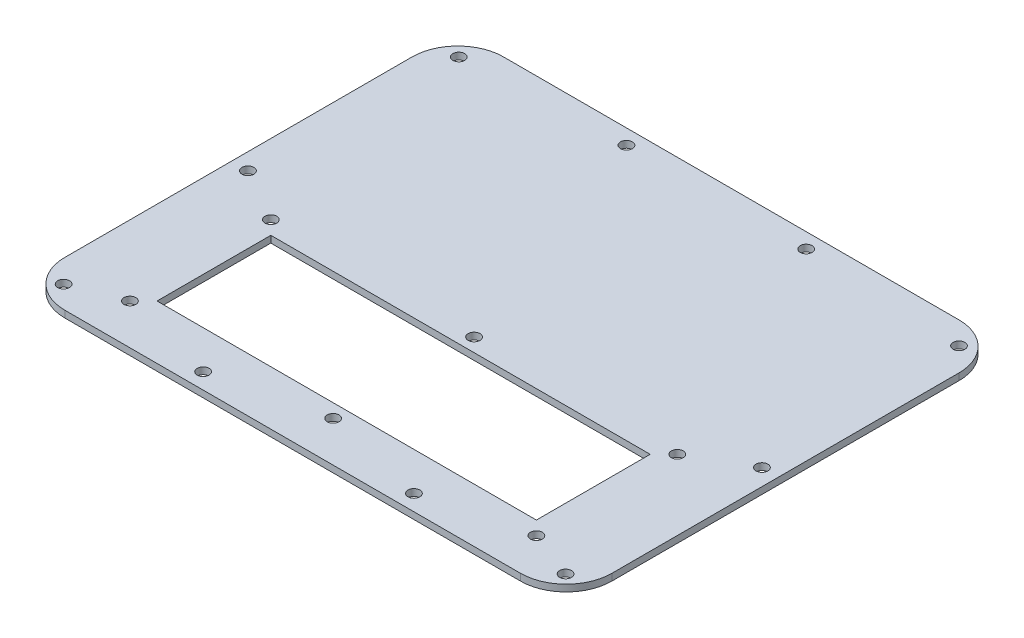
ISO-10303-21;
HEADER;
FILE_DESCRIPTION(('STEP AP214'),'2;1');
FILE_NAME('part.step','',(''),(''),'','','');
FILE_SCHEMA(('AUTOMOTIVE_DESIGN { 1 0 10303 214 1 1 1 1 }'));
ENDSEC;
DATA;
#1=APPLICATION_CONTEXT('core data for automotive mechanical design processes');
#2=APPLICATION_PROTOCOL_DEFINITION('international standard','automotive_design',2000,#1);
#3=PRODUCT_CONTEXT('',#1,'mechanical');
#4=PRODUCT('Part','Part','',(#3));
#5=PRODUCT_RELATED_PRODUCT_CATEGORY('part','',(#4));
#6=PRODUCT_DEFINITION_FORMATION('','',#4);
#7=PRODUCT_DEFINITION_CONTEXT('part definition',#1,'design');
#8=PRODUCT_DEFINITION('design','',#6,#7);
#9=PRODUCT_DEFINITION_SHAPE('','',#8);
#10=(LENGTH_UNIT() NAMED_UNIT(*) SI_UNIT(.MILLI.,.METRE.));
#11=(NAMED_UNIT(*) PLANE_ANGLE_UNIT() SI_UNIT($,.RADIAN.));
#12=(NAMED_UNIT(*) SI_UNIT($,.STERADIAN.) SOLID_ANGLE_UNIT());
#13=UNCERTAINTY_MEASURE_WITH_UNIT(LENGTH_MEASURE(1.E-05),#10,'distance_accuracy_value','');
#14=(GEOMETRIC_REPRESENTATION_CONTEXT(3) GLOBAL_UNCERTAINTY_ASSIGNED_CONTEXT((#13)) GLOBAL_UNIT_ASSIGNED_CONTEXT((#10,
#11,#12)) REPRESENTATION_CONTEXT('',''));
#15=CARTESIAN_POINT('',(0.,0.,0.));
#16=DIRECTION('',(0.,0.,1.));
#17=DIRECTION('',(1.,0.,0.));
#18=AXIS2_PLACEMENT_3D('',#15,#16,#17);
#19=CARTESIAN_POINT('',(-106.7689,3.175,81.3689000000001));
#20=DIRECTION('',(0.,-1.,0.));
#21=DIRECTION('',(0.,0.,-1.));
#22=AXIS2_PLACEMENT_3D('',#19,#20,#21);
#23=PLANE('',#22);
#24=CARTESIAN_POINT('',(-95.25,3.175,83.82));
#25=DIRECTION('',(0.,1.,0.));
#26=DIRECTION('',(0.,0.,-1.));
#27=AXIS2_PLACEMENT_3D('',#24,#25,#26);
#28=CIRCLE('',#27,2.7813);
#29=CARTESIAN_POINT('',(-95.25,3.175,81.0387));
#30=VERTEX_POINT('',#29);
#31=EDGE_CURVE('E532',#30,#30,#28,.T.);
#32=ORIENTED_EDGE('',*,*,#31,.F.);
#33=EDGE_LOOP('',(#32));
#34=FACE_BOUND('',#33,.T.);
#35=CARTESIAN_POINT('',(0.,3.175,83.82));
#36=DIRECTION('',(0.,1.,0.));
#37=DIRECTION('',(0.,0.,-1.));
#38=AXIS2_PLACEMENT_3D('',#35,#36,#37);
#39=CIRCLE('',#38,2.7813);
#40=CARTESIAN_POINT('',(0.,3.175,81.0387));
#41=VERTEX_POINT('',#40);
#42=EDGE_CURVE('E524',#41,#41,#39,.T.);
#43=ORIENTED_EDGE('',*,*,#42,.F.);
#44=EDGE_LOOP('',(#43));
#45=FACE_BOUND('',#44,.T.);
#46=CARTESIAN_POINT('',(95.25,3.175,83.82));
#47=DIRECTION('',(0.,1.,0.));
#48=DIRECTION('',(0.,0.,-1.));
#49=AXIS2_PLACEMENT_3D('',#46,#47,#48);
#50=CIRCLE('',#49,2.7813);
#51=CARTESIAN_POINT('',(95.25,3.175,81.0387));
#52=VERTEX_POINT('',#51);
#53=EDGE_CURVE('E516',#52,#52,#50,.T.);
#54=ORIENTED_EDGE('',*,*,#53,.F.);
#55=EDGE_LOOP('',(#54));
#56=FACE_BOUND('',#55,.T.);
#57=CARTESIAN_POINT('',(95.25,3.175,17.78));
#58=DIRECTION('',(0.,1.,0.));
#59=DIRECTION('',(0.,0.,1.));
#60=AXIS2_PLACEMENT_3D('',#57,#58,#59);
#61=CIRCLE('',#60,2.7813);
#62=CARTESIAN_POINT('',(95.25,3.175,20.5613));
#63=VERTEX_POINT('',#62);
#64=EDGE_CURVE('E508',#63,#63,#61,.T.);
#65=ORIENTED_EDGE('',*,*,#64,.F.);
#66=EDGE_LOOP('',(#65));
#67=FACE_BOUND('',#66,.T.);
#68=CARTESIAN_POINT('',(0.,3.175,17.78));
#69=DIRECTION('',(0.,1.,0.));
#70=DIRECTION('',(0.,0.,1.));
#71=AXIS2_PLACEMENT_3D('',#68,#69,#70);
#72=CIRCLE('',#71,2.7813);
#73=CARTESIAN_POINT('',(0.,3.175,20.5613));
#74=VERTEX_POINT('',#73);
#75=EDGE_CURVE('E491',#74,#74,#72,.T.);
#76=ORIENTED_EDGE('',*,*,#75,.F.);
#77=EDGE_LOOP('',(#76));
#78=FACE_BOUND('',#77,.T.);
#79=CARTESIAN_POINT('',(-95.25,3.175,17.78));
#80=DIRECTION('',(0.,1.,0.));
#81=DIRECTION('',(0.,0.,1.));
#82=AXIS2_PLACEMENT_3D('',#79,#80,#81);
#83=CIRCLE('',#82,2.7813);
#84=CARTESIAN_POINT('',(-95.25,3.175,20.5613));
#85=VERTEX_POINT('',#84);
#86=EDGE_CURVE('E168',#85,#85,#83,.T.);
#87=ORIENTED_EDGE('',*,*,#86,.F.);
#88=EDGE_LOOP('',(#87));
#89=FACE_BOUND('',#88,.T.);
#90=CARTESIAN_POINT('',(-42.1132000000002,3.175,-95.7452999999999));
#91=DIRECTION('',(0.,1.,0.));
#92=DIRECTION('',(0.,0.,-1.));
#93=AXIS2_PLACEMENT_3D('',#90,#91,#92);
#94=CIRCLE('',#93,2.7813);
#95=CARTESIAN_POINT('',(-42.1132000000002,3.175,-98.5265999999999));
#96=VERTEX_POINT('',#95);
#97=EDGE_CURVE('E184',#96,#96,#94,.T.);
#98=ORIENTED_EDGE('',*,*,#97,.F.);
#99=EDGE_LOOP('',(#98));
#100=FACE_BOUND('',#99,.T.);
#101=CARTESIAN_POINT('',(-117.221,3.175,-92.2908999999999));
#102=DIRECTION('',(0.,1.,0.));
#103=DIRECTION('',(0.,0.,-1.));
#104=AXIS2_PLACEMENT_3D('',#101,#102,#103);
#105=CIRCLE('',#104,2.7813);
#106=CARTESIAN_POINT('',(-117.221,3.175,-95.0721999999999));
#107=VERTEX_POINT('',#106);
#108=EDGE_CURVE('E192',#107,#107,#105,.T.);
#109=ORIENTED_EDGE('',*,*,#108,.F.);
#110=EDGE_LOOP('',(#109));
#111=FACE_BOUND('',#110,.T.);
#112=CARTESIAN_POINT('',(-120.4468,3.175,3.3147));
#113=DIRECTION('',(0.,1.,0.));
#114=DIRECTION('',(0.,0.,-1.));
#115=AXIS2_PLACEMENT_3D('',#112,#113,#114);
#116=CIRCLE('',#115,2.7813);
#117=CARTESIAN_POINT('',(-120.4468,3.175,0.533400000000007));
#118=VERTEX_POINT('',#117);
#119=EDGE_CURVE('E200',#118,#118,#116,.T.);
#120=ORIENTED_EDGE('',*,*,#119,.F.);
#121=EDGE_LOOP('',(#120));
#122=FACE_BOUND('',#121,.T.);
#123=CARTESIAN_POINT('',(-117.6274,3.175,92.5195));
#124=DIRECTION('',(0.,1.,0.));
#125=DIRECTION('',(0.,0.,-1.));
#126=AXIS2_PLACEMENT_3D('',#123,#124,#125);
#127=CIRCLE('',#126,2.7813);
#128=CARTESIAN_POINT('',(-117.6274,3.175,89.7381999999999));
#129=VERTEX_POINT('',#128);
#130=EDGE_CURVE('E208',#129,#129,#127,.T.);
#131=ORIENTED_EDGE('',*,*,#130,.F.);
#132=EDGE_LOOP('',(#131));
#133=FACE_BOUND('',#132,.T.);
#134=CARTESIAN_POINT('',(-49.4030000000002,3.175,95.3643));
#135=DIRECTION('',(0.,1.,0.));
#136=DIRECTION('',(0.,0.,-1.));
#137=AXIS2_PLACEMENT_3D('',#134,#135,#136);
#138=CIRCLE('',#137,2.7813);
#139=CARTESIAN_POINT('',(-49.4030000000002,3.175,92.583));
#140=VERTEX_POINT('',#139);
#141=EDGE_CURVE('E216',#140,#140,#138,.T.);
#142=ORIENTED_EDGE('',*,*,#141,.F.);
#143=EDGE_LOOP('',(#142));
#144=FACE_BOUND('',#143,.T.);
#145=CARTESIAN_POINT('',(49.403,3.175,95.3643));
#146=DIRECTION('',(0.,1.,0.));
#147=DIRECTION('',(0.,0.,1.));
#148=AXIS2_PLACEMENT_3D('',#145,#146,#147);
#149=CIRCLE('',#148,2.7813);
#150=CARTESIAN_POINT('',(49.403,3.175,98.1456));
#151=VERTEX_POINT('',#150);
#152=EDGE_CURVE('E224',#151,#151,#149,.T.);
#153=ORIENTED_EDGE('',*,*,#152,.F.);
#154=EDGE_LOOP('',(#153));
#155=FACE_BOUND('',#154,.T.);
#156=CARTESIAN_POINT('',(120.4468,3.175,3.3147));
#157=DIRECTION('',(0.,1.,0.));
#158=DIRECTION('',(0.,0.,1.));
#159=AXIS2_PLACEMENT_3D('',#156,#157,#158);
#160=CIRCLE('',#159,2.7813);
#161=CARTESIAN_POINT('',(120.4468,3.175,6.096));
#162=VERTEX_POINT('',#161);
#163=EDGE_CURVE('E232',#162,#162,#160,.T.);
#164=ORIENTED_EDGE('',*,*,#163,.F.);
#165=EDGE_LOOP('',(#164));
#166=FACE_BOUND('',#165,.T.);
#167=CARTESIAN_POINT('',(117.6274,3.175,92.5195));
#168=DIRECTION('',(0.,1.,0.));
#169=DIRECTION('',(0.,0.,1.));
#170=AXIS2_PLACEMENT_3D('',#167,#168,#169);
#171=CIRCLE('',#170,2.7813);
#172=CARTESIAN_POINT('',(117.6274,3.175,95.3008));
#173=VERTEX_POINT('',#172);
#174=EDGE_CURVE('E240',#173,#173,#171,.T.);
#175=ORIENTED_EDGE('',*,*,#174,.F.);
#176=EDGE_LOOP('',(#175));
#177=FACE_BOUND('',#176,.T.);
#178=CARTESIAN_POINT('',(117.221,3.175,-92.2909));
#179=DIRECTION('',(0.,1.,0.));
#180=DIRECTION('',(0.,0.,1.));
#181=AXIS2_PLACEMENT_3D('',#178,#179,#180);
#182=CIRCLE('',#181,2.7813);
#183=CARTESIAN_POINT('',(117.221,3.175,-89.5096));
#184=VERTEX_POINT('',#183);
#185=EDGE_CURVE('E248',#184,#184,#182,.T.);
#186=ORIENTED_EDGE('',*,*,#185,.F.);
#187=EDGE_LOOP('',(#186));
#188=FACE_BOUND('',#187,.T.);
#189=CARTESIAN_POINT('',(42.1132,3.175,-95.7453));
#190=DIRECTION('',(0.,1.,0.));
#191=DIRECTION('',(0.,0.,1.));
#192=AXIS2_PLACEMENT_3D('',#189,#190,#191);
#193=CIRCLE('',#192,2.7813);
#194=CARTESIAN_POINT('',(42.1132,3.175,-92.964));
#195=VERTEX_POINT('',#194);
#196=EDGE_CURVE('E256',#195,#195,#193,.T.);
#197=ORIENTED_EDGE('',*,*,#196,.F.);
#198=EDGE_LOOP('',(#197));
#199=FACE_BOUND('',#198,.T.);
#200=CARTESIAN_POINT('',(-106.7689,3.175,81.3689000000001));
#201=DIRECTION('',(0.,1.,0.));
#202=DIRECTION('',(0.,0.,-1.));
#203=AXIS2_PLACEMENT_3D('',#200,#201,#202);
#204=CIRCLE('',#203,21.4376);
#205=CARTESIAN_POINT('',(-128.2065,3.175,81.3688999999999));
#206=VERTEX_POINT('',#205);
#207=CARTESIAN_POINT('',(-106.7689,3.175,102.8065));
#208=VERTEX_POINT('',#207);
#209=EDGE_CURVE('E264',#206,#208,#204,.T.);
#210=ORIENTED_EDGE('',*,*,#209,.T.);
#211=DIRECTION('',(1.,0.,0.));
#212=VECTOR('',#211,1.);
#213=CARTESIAN_POINT('',(-106.7689,3.175,102.8065));
#214=LINE('',#213,#212);
#215=CARTESIAN_POINT('',(106.7689,3.175,102.8065));
#216=VERTEX_POINT('',#215);
#217=EDGE_CURVE('E268',#208,#216,#214,.T.);
#218=ORIENTED_EDGE('',*,*,#217,.T.);
#219=CARTESIAN_POINT('',(106.7689,3.175,81.3689000000001));
#220=DIRECTION('',(0.,1.,0.));
#221=DIRECTION('',(0.,0.,1.));
#222=AXIS2_PLACEMENT_3D('',#219,#220,#221);
#223=CIRCLE('',#222,21.4376);
#224=CARTESIAN_POINT('',(128.2065,3.175,81.3688999999999));
#225=VERTEX_POINT('',#224);
#226=EDGE_CURVE('E272',#216,#225,#223,.T.);
#227=ORIENTED_EDGE('',*,*,#226,.T.);
#228=DIRECTION('',(0.,0.,-1.));
#229=VECTOR('',#228,1.);
#230=CARTESIAN_POINT('',(128.2065,3.175,81.3688999999999));
#231=LINE('',#230,#229);
#232=CARTESIAN_POINT('',(128.2065,3.175,-81.3688999999998));
#233=VERTEX_POINT('',#232);
#234=EDGE_CURVE('E275',#225,#233,#231,.T.);
#235=ORIENTED_EDGE('',*,*,#234,.T.);
#236=CARTESIAN_POINT('',(106.7689,3.175,-81.3689));
#237=DIRECTION('',(0.,1.,0.));
#238=DIRECTION('',(0.,0.,-1.));
#239=AXIS2_PLACEMENT_3D('',#236,#237,#238);
#240=CIRCLE('',#239,21.4376);
#241=CARTESIAN_POINT('',(106.7689,3.175,-102.8065));
#242=VERTEX_POINT('',#241);
#243=EDGE_CURVE('E278',#233,#242,#240,.T.);
#244=ORIENTED_EDGE('',*,*,#243,.T.);
#245=DIRECTION('',(-1.,0.,0.));
#246=VECTOR('',#245,1.);
#247=CARTESIAN_POINT('',(-106.7689,3.175,-102.8065));
#248=LINE('',#247,#246);
#249=CARTESIAN_POINT('',(-106.7689,3.175,-102.8065));
#250=VERTEX_POINT('',#249);
#251=EDGE_CURVE('E281',#242,#250,#248,.T.);
#252=ORIENTED_EDGE('',*,*,#251,.T.);
#253=CARTESIAN_POINT('',(-106.7689,3.175,-81.3689));
#254=DIRECTION('',(0.,1.,0.));
#255=DIRECTION('',(0.,0.,-1.));
#256=AXIS2_PLACEMENT_3D('',#253,#254,#255);
#257=CIRCLE('',#256,21.4376);
#258=CARTESIAN_POINT('',(-128.2065,3.175,-81.3688999999998));
#259=VERTEX_POINT('',#258);
#260=EDGE_CURVE('E284',#250,#259,#257,.T.);
#261=ORIENTED_EDGE('',*,*,#260,.T.);
#262=DIRECTION('',(0.,0.,1.));
#263=VECTOR('',#262,1.);
#264=CARTESIAN_POINT('',(-128.2065,3.175,81.3688999999999));
#265=LINE('',#264,#263);
#266=EDGE_CURVE('E287',#259,#206,#265,.T.);
#267=ORIENTED_EDGE('',*,*,#266,.T.);
#268=EDGE_LOOP('',(#210,#218,#227,#235,#244,#252,#261,#267));
#269=FACE_BOUND('',#268,.T.);
#270=DIRECTION('',(0.,0.,-1.));
#271=VECTOR('',#270,1.);
#272=CARTESIAN_POINT('',(88.9,3.175,24.13));
#273=LINE('',#272,#271);
#274=CARTESIAN_POINT('',(88.9,3.175,77.47));
#275=VERTEX_POINT('',#274);
#276=CARTESIAN_POINT('',(88.9,3.175,24.13));
#277=VERTEX_POINT('',#276);
#278=EDGE_CURVE('E134',#275,#277,#273,.T.);
#279=ORIENTED_EDGE('',*,*,#278,.F.);
#280=DIRECTION('',(1.,0.,0.));
#281=VECTOR('',#280,1.);
#282=CARTESIAN_POINT('',(-88.9,3.175,77.47));
#283=LINE('',#282,#281);
#284=CARTESIAN_POINT('',(-88.9,3.175,77.47));
#285=VERTEX_POINT('',#284);
#286=EDGE_CURVE('E160',#285,#275,#283,.T.);
#287=ORIENTED_EDGE('',*,*,#286,.F.);
#288=DIRECTION('',(0.,0.,1.));
#289=VECTOR('',#288,1.);
#290=CARTESIAN_POINT('',(-88.9,3.175,24.13));
#291=LINE('',#290,#289);
#292=CARTESIAN_POINT('',(-88.9,3.175,24.13));
#293=VERTEX_POINT('',#292);
#294=EDGE_CURVE('E156',#293,#285,#291,.T.);
#295=ORIENTED_EDGE('',*,*,#294,.F.);
#296=DIRECTION('',(-1.,0.,0.));
#297=VECTOR('',#296,1.);
#298=CARTESIAN_POINT('',(-88.9,3.175,24.13));
#299=LINE('',#298,#297);
#300=EDGE_CURVE('E143',#277,#293,#299,.T.);
#301=ORIENTED_EDGE('',*,*,#300,.F.);
#302=EDGE_LOOP('',(#279,#287,#295,#301));
#303=FACE_BOUND('',#302,.T.);
#304=ADVANCED_FACE('F44',(#34,#45,#56,#67,#78,#89,#100,#111,#122,#133,#144,#155,#166,#177,#188,
#199,#269,#303),#23,.F.);
#305=CARTESIAN_POINT('',(-106.7689,0.,81.3689000000001));
#306=DIRECTION('',(0.,-1.,0.));
#307=DIRECTION('',(0.,0.,-1.));
#308=AXIS2_PLACEMENT_3D('',#305,#306,#307);
#309=PLANE('',#308);
#310=CARTESIAN_POINT('',(-95.25,0.,83.82));
#311=DIRECTION('',(0.,1.,0.));
#312=DIRECTION('',(0.,0.,-1.));
#313=AXIS2_PLACEMENT_3D('',#310,#311,#312);
#314=CIRCLE('',#313,2.7813);
#315=CARTESIAN_POINT('',(-95.25,0.,81.0387));
#316=VERTEX_POINT('',#315);
#317=EDGE_CURVE('E528',#316,#316,#314,.T.);
#318=ORIENTED_EDGE('',*,*,#317,.T.);
#319=EDGE_LOOP('',(#318));
#320=FACE_BOUND('',#319,.T.);
#321=CARTESIAN_POINT('',(0.,0.,83.82));
#322=DIRECTION('',(0.,1.,0.));
#323=DIRECTION('',(0.,0.,-1.));
#324=AXIS2_PLACEMENT_3D('',#321,#322,#323);
#325=CIRCLE('',#324,2.7813);
#326=CARTESIAN_POINT('',(0.,0.,81.0387));
#327=VERTEX_POINT('',#326);
#328=EDGE_CURVE('E520',#327,#327,#325,.T.);
#329=ORIENTED_EDGE('',*,*,#328,.T.);
#330=EDGE_LOOP('',(#329));
#331=FACE_BOUND('',#330,.T.);
#332=CARTESIAN_POINT('',(95.25,0.,83.82));
#333=DIRECTION('',(0.,1.,0.));
#334=DIRECTION('',(0.,0.,-1.));
#335=AXIS2_PLACEMENT_3D('',#332,#333,#334);
#336=CIRCLE('',#335,2.7813);
#337=CARTESIAN_POINT('',(95.25,0.,81.0387));
#338=VERTEX_POINT('',#337);
#339=EDGE_CURVE('E512',#338,#338,#336,.T.);
#340=ORIENTED_EDGE('',*,*,#339,.T.);
#341=EDGE_LOOP('',(#340));
#342=FACE_BOUND('',#341,.T.);
#343=CARTESIAN_POINT('',(95.25,0.,17.78));
#344=DIRECTION('',(0.,1.,0.));
#345=DIRECTION('',(0.,0.,1.));
#346=AXIS2_PLACEMENT_3D('',#343,#344,#345);
#347=CIRCLE('',#346,2.7813);
#348=CARTESIAN_POINT('',(95.25,0.,20.5613));
#349=VERTEX_POINT('',#348);
#350=EDGE_CURVE('E502',#349,#349,#347,.T.);
#351=ORIENTED_EDGE('',*,*,#350,.T.);
#352=EDGE_LOOP('',(#351));
#353=FACE_BOUND('',#352,.T.);
#354=CARTESIAN_POINT('',(0.,0.,17.78));
#355=DIRECTION('',(0.,1.,0.));
#356=DIRECTION('',(0.,0.,1.));
#357=AXIS2_PLACEMENT_3D('',#354,#355,#356);
#358=CIRCLE('',#357,2.7813);
#359=CARTESIAN_POINT('',(0.,0.,20.5613));
#360=VERTEX_POINT('',#359);
#361=EDGE_CURVE('E494',#360,#360,#358,.T.);
#362=ORIENTED_EDGE('',*,*,#361,.T.);
#363=EDGE_LOOP('',(#362));
#364=FACE_BOUND('',#363,.T.);
#365=CARTESIAN_POINT('',(-95.25,0.,17.78));
#366=DIRECTION('',(0.,1.,0.));
#367=DIRECTION('',(0.,0.,1.));
#368=AXIS2_PLACEMENT_3D('',#365,#366,#367);
#369=CIRCLE('',#368,2.7813);
#370=CARTESIAN_POINT('',(-95.25,0.,20.5613));
#371=VERTEX_POINT('',#370);
#372=EDGE_CURVE('E497',#371,#371,#369,.T.);
#373=ORIENTED_EDGE('',*,*,#372,.T.);
#374=EDGE_LOOP('',(#373));
#375=FACE_BOUND('',#374,.T.);
#376=CARTESIAN_POINT('',(-117.221,0.,-92.2908999999999));
#377=DIRECTION('',(0.,1.,0.));
#378=DIRECTION('',(0.,0.,-1.));
#379=AXIS2_PLACEMENT_3D('',#376,#377,#378);
#380=CIRCLE('',#379,2.7813);
#381=CARTESIAN_POINT('',(-117.221,0.,-95.0721999999999));
#382=VERTEX_POINT('',#381);
#383=EDGE_CURVE('E188',#382,#382,#380,.T.);
#384=ORIENTED_EDGE('',*,*,#383,.T.);
#385=EDGE_LOOP('',(#384));
#386=FACE_BOUND('',#385,.T.);
#387=CARTESIAN_POINT('',(-117.6274,0.,92.5195));
#388=DIRECTION('',(0.,1.,0.));
#389=DIRECTION('',(0.,0.,-1.));
#390=AXIS2_PLACEMENT_3D('',#387,#388,#389);
#391=CIRCLE('',#390,2.7813);
#392=CARTESIAN_POINT('',(-117.6274,0.,89.7381999999999));
#393=VERTEX_POINT('',#392);
#394=EDGE_CURVE('E204',#393,#393,#391,.T.);
#395=ORIENTED_EDGE('',*,*,#394,.T.);
#396=EDGE_LOOP('',(#395));
#397=FACE_BOUND('',#396,.T.);
#398=CARTESIAN_POINT('',(49.403,0.,95.3643));
#399=DIRECTION('',(0.,1.,0.));
#400=DIRECTION('',(0.,0.,1.));
#401=AXIS2_PLACEMENT_3D('',#398,#399,#400);
#402=CIRCLE('',#401,2.7813);
#403=CARTESIAN_POINT('',(49.403,0.,98.1456));
#404=VERTEX_POINT('',#403);
#405=EDGE_CURVE('E220',#404,#404,#402,.T.);
#406=ORIENTED_EDGE('',*,*,#405,.T.);
#407=EDGE_LOOP('',(#406));
#408=FACE_BOUND('',#407,.T.);
#409=CARTESIAN_POINT('',(117.6274,0.,92.5195));
#410=DIRECTION('',(0.,1.,0.));
#411=DIRECTION('',(0.,0.,1.));
#412=AXIS2_PLACEMENT_3D('',#409,#410,#411);
#413=CIRCLE('',#412,2.7813);
#414=CARTESIAN_POINT('',(117.6274,0.,95.3008));
#415=VERTEX_POINT('',#414);
#416=EDGE_CURVE('E236',#415,#415,#413,.T.);
#417=ORIENTED_EDGE('',*,*,#416,.T.);
#418=EDGE_LOOP('',(#417));
#419=FACE_BOUND('',#418,.T.);
#420=CARTESIAN_POINT('',(42.1132,0.,-95.7453));
#421=DIRECTION('',(0.,1.,0.));
#422=DIRECTION('',(0.,0.,1.));
#423=AXIS2_PLACEMENT_3D('',#420,#421,#422);
#424=CIRCLE('',#423,2.7813);
#425=CARTESIAN_POINT('',(42.1132,0.,-92.964));
#426=VERTEX_POINT('',#425);
#427=EDGE_CURVE('E252',#426,#426,#424,.T.);
#428=ORIENTED_EDGE('',*,*,#427,.T.);
#429=EDGE_LOOP('',(#428));
#430=FACE_BOUND('',#429,.T.);
#431=CARTESIAN_POINT('',(-106.7689,0.,81.3689000000001));
#432=DIRECTION('',(0.,1.,0.));
#433=DIRECTION('',(0.,0.,-1.));
#434=AXIS2_PLACEMENT_3D('',#431,#432,#433);
#435=CIRCLE('',#434,21.4376);
#436=CARTESIAN_POINT('',(-128.2065,0.,81.3688999999999));
#437=VERTEX_POINT('',#436);
#438=CARTESIAN_POINT('',(-106.7689,0.,102.8065));
#439=VERTEX_POINT('',#438);
#440=EDGE_CURVE('E260',#437,#439,#435,.T.);
#441=ORIENTED_EDGE('',*,*,#440,.F.);
#442=DIRECTION('',(0.,0.,1.));
#443=VECTOR('',#442,1.);
#444=CARTESIAN_POINT('',(-128.2065,0.,81.3688999999999));
#445=LINE('',#444,#443);
#446=CARTESIAN_POINT('',(-128.2065,0.,-81.3688999999998));
#447=VERTEX_POINT('',#446);
#448=EDGE_CURVE('E269',#447,#437,#445,.T.);
#449=ORIENTED_EDGE('',*,*,#448,.F.);
#450=CARTESIAN_POINT('',(-106.7689,0.,-81.3689));
#451=DIRECTION('',(0.,1.,0.));
#452=DIRECTION('',(0.,0.,-1.));
#453=AXIS2_PLACEMENT_3D('',#450,#451,#452);
#454=CIRCLE('',#453,21.4376);
#455=CARTESIAN_POINT('',(-106.7689,0.,-102.8065));
#456=VERTEX_POINT('',#455);
#457=EDGE_CURVE('E309',#456,#447,#454,.T.);
#458=ORIENTED_EDGE('',*,*,#457,.F.);
#459=DIRECTION('',(-1.,0.,0.));
#460=VECTOR('',#459,1.);
#461=CARTESIAN_POINT('',(-106.7689,0.,-102.8065));
#462=LINE('',#461,#460);
#463=CARTESIAN_POINT('',(106.7689,0.,-102.8065));
#464=VERTEX_POINT('',#463);
#465=EDGE_CURVE('E306',#464,#456,#462,.T.);
#466=ORIENTED_EDGE('',*,*,#465,.F.);
#467=CARTESIAN_POINT('',(106.7689,0.,-81.3689));
#468=DIRECTION('',(0.,1.,0.));
#469=DIRECTION('',(0.,0.,-1.));
#470=AXIS2_PLACEMENT_3D('',#467,#468,#469);
#471=CIRCLE('',#470,21.4376);
#472=CARTESIAN_POINT('',(128.2065,0.,-81.3688999999998));
#473=VERTEX_POINT('',#472);
#474=EDGE_CURVE('E303',#473,#464,#471,.T.);
#475=ORIENTED_EDGE('',*,*,#474,.F.);
#476=DIRECTION('',(0.,0.,-1.));
#477=VECTOR('',#476,1.);
#478=CARTESIAN_POINT('',(128.2065,0.,81.3688999999999));
#479=LINE('',#478,#477);
#480=CARTESIAN_POINT('',(128.2065,0.,81.3688999999999));
#481=VERTEX_POINT('',#480);
#482=EDGE_CURVE('E300',#481,#473,#479,.T.);
#483=ORIENTED_EDGE('',*,*,#482,.F.);
#484=CARTESIAN_POINT('',(106.7689,0.,81.3689000000001));
#485=DIRECTION('',(0.,1.,0.));
#486=DIRECTION('',(0.,0.,1.));
#487=AXIS2_PLACEMENT_3D('',#484,#485,#486);
#488=CIRCLE('',#487,21.4376);
#489=CARTESIAN_POINT('',(106.7689,0.,102.8065));
#490=VERTEX_POINT('',#489);
#491=EDGE_CURVE('E297',#490,#481,#488,.T.);
#492=ORIENTED_EDGE('',*,*,#491,.F.);
#493=DIRECTION('',(1.,0.,0.));
#494=VECTOR('',#493,1.);
#495=CARTESIAN_POINT('',(-106.7689,0.,102.8065));
#496=LINE('',#495,#494);
#497=EDGE_CURVE('E294',#439,#490,#496,.T.);
#498=ORIENTED_EDGE('',*,*,#497,.F.);
#499=EDGE_LOOP('',(#441,#449,#458,#466,#475,#483,#492,#498));
#500=FACE_BOUND('',#499,.T.);
#501=CARTESIAN_POINT('',(117.221,0.,-92.2909));
#502=DIRECTION('',(0.,1.,0.));
#503=DIRECTION('',(0.,0.,1.));
#504=AXIS2_PLACEMENT_3D('',#501,#502,#503);
#505=CIRCLE('',#504,2.7813);
#506=CARTESIAN_POINT('',(117.221,0.,-89.5096));
#507=VERTEX_POINT('',#506);
#508=EDGE_CURVE('E244',#507,#507,#505,.T.);
#509=ORIENTED_EDGE('',*,*,#508,.T.);
#510=EDGE_LOOP('',(#509));
#511=FACE_BOUND('',#510,.T.);
#512=CARTESIAN_POINT('',(120.4468,0.,3.3147));
#513=DIRECTION('',(0.,1.,0.));
#514=DIRECTION('',(0.,0.,1.));
#515=AXIS2_PLACEMENT_3D('',#512,#513,#514);
#516=CIRCLE('',#515,2.7813);
#517=CARTESIAN_POINT('',(120.4468,0.,6.096));
#518=VERTEX_POINT('',#517);
#519=EDGE_CURVE('E228',#518,#518,#516,.T.);
#520=ORIENTED_EDGE('',*,*,#519,.T.);
#521=EDGE_LOOP('',(#520));
#522=FACE_BOUND('',#521,.T.);
#523=CARTESIAN_POINT('',(-49.4030000000002,0.,95.3643));
#524=DIRECTION('',(0.,1.,0.));
#525=DIRECTION('',(0.,0.,-1.));
#526=AXIS2_PLACEMENT_3D('',#523,#524,#525);
#527=CIRCLE('',#526,2.7813);
#528=CARTESIAN_POINT('',(-49.4030000000002,0.,92.583));
#529=VERTEX_POINT('',#528);
#530=EDGE_CURVE('E212',#529,#529,#527,.T.);
#531=ORIENTED_EDGE('',*,*,#530,.T.);
#532=EDGE_LOOP('',(#531));
#533=FACE_BOUND('',#532,.T.);
#534=CARTESIAN_POINT('',(-120.4468,0.,3.3147));
#535=DIRECTION('',(0.,1.,0.));
#536=DIRECTION('',(0.,0.,-1.));
#537=AXIS2_PLACEMENT_3D('',#534,#535,#536);
#538=CIRCLE('',#537,2.7813);
#539=CARTESIAN_POINT('',(-120.4468,0.,0.533400000000007));
#540=VERTEX_POINT('',#539);
#541=EDGE_CURVE('E196',#540,#540,#538,.T.);
#542=ORIENTED_EDGE('',*,*,#541,.T.);
#543=EDGE_LOOP('',(#542));
#544=FACE_BOUND('',#543,.T.);
#545=CARTESIAN_POINT('',(-42.1132000000002,0.,-95.7452999999999));
#546=DIRECTION('',(0.,1.,0.));
#547=DIRECTION('',(0.,0.,-1.));
#548=AXIS2_PLACEMENT_3D('',#545,#546,#547);
#549=CIRCLE('',#548,2.7813);
#550=CARTESIAN_POINT('',(-42.1132000000002,0.,-98.5265999999999));
#551=VERTEX_POINT('',#550);
#552=EDGE_CURVE('E152',#551,#551,#549,.T.);
#553=ORIENTED_EDGE('',*,*,#552,.T.);
#554=EDGE_LOOP('',(#553));
#555=FACE_BOUND('',#554,.T.);
#556=DIRECTION('',(1.,0.,0.));
#557=VECTOR('',#556,1.);
#558=CARTESIAN_POINT('',(-88.9,0.,77.47));
#559=LINE('',#558,#557);
#560=CARTESIAN_POINT('',(-88.9,0.,77.47));
#561=VERTEX_POINT('',#560);
#562=CARTESIAN_POINT('',(88.9,0.,77.47));
#563=VERTEX_POINT('',#562);
#564=EDGE_CURVE('E144',#561,#563,#559,.T.);
#565=ORIENTED_EDGE('',*,*,#564,.T.);
#566=DIRECTION('',(0.,0.,-1.));
#567=VECTOR('',#566,1.);
#568=CARTESIAN_POINT('',(88.9,0.,24.13));
#569=LINE('',#568,#567);
#570=CARTESIAN_POINT('',(88.9,0.,24.13));
#571=VERTEX_POINT('',#570);
#572=EDGE_CURVE('E68',#563,#571,#569,.T.);
#573=ORIENTED_EDGE('',*,*,#572,.T.);
#574=DIRECTION('',(-1.,0.,0.));
#575=VECTOR('',#574,1.);
#576=CARTESIAN_POINT('',(-88.9,0.,24.13));
#577=LINE('',#576,#575);
#578=CARTESIAN_POINT('',(-88.9,0.,24.13));
#579=VERTEX_POINT('',#578);
#580=EDGE_CURVE('E150',#571,#579,#577,.T.);
#581=ORIENTED_EDGE('',*,*,#580,.T.);
#582=DIRECTION('',(0.,0.,1.));
#583=VECTOR('',#582,1.);
#584=CARTESIAN_POINT('',(-88.9,0.,24.13));
#585=LINE('',#584,#583);
#586=EDGE_CURVE('E171',#579,#561,#585,.T.);
#587=ORIENTED_EDGE('',*,*,#586,.T.);
#588=EDGE_LOOP('',(#565,#573,#581,#587));
#589=FACE_BOUND('',#588,.T.);
#590=ADVANCED_FACE('F348',(#320,#331,#342,#353,#364,#375,#386,#397,#408,#419,#430,#500,#511,
#522,#533,#544,#555,#589),#309,.T.);
#591=CARTESIAN_POINT('',(-106.7689,3.175,81.3689000000001));
#592=DIRECTION('',(0.,-1.,0.));
#593=DIRECTION('',(0.,0.,-1.));
#594=AXIS2_PLACEMENT_3D('',#591,#592,#593);
#595=CYLINDRICAL_SURFACE('',#594,21.4376);
#596=ORIENTED_EDGE('',*,*,#440,.T.);
#597=DIRECTION('',(0.,-1.,0.));
#598=VECTOR('',#597,1.);
#599=CARTESIAN_POINT('',(-106.7689,3.175,102.8065));
#600=LINE('',#599,#598);
#601=EDGE_CURVE('E11',#208,#439,#600,.T.);
#602=ORIENTED_EDGE('',*,*,#601,.F.);
#603=ORIENTED_EDGE('',*,*,#209,.F.);
#604=DIRECTION('',(0.,-1.,0.));
#605=VECTOR('',#604,1.);
#606=CARTESIAN_POINT('',(-128.2065,3.175,81.3688999999999));
#607=LINE('',#606,#605);
#608=EDGE_CURVE('E290',#206,#437,#607,.T.);
#609=ORIENTED_EDGE('',*,*,#608,.T.);
#610=EDGE_LOOP('',(#596,#602,#603,#609));
#611=FACE_BOUND('',#610,.T.);
#612=ADVANCED_FACE('F46',(#611),#595,.T.);
#613=CARTESIAN_POINT('',(-106.7689,3.175,102.8065));
#614=DIRECTION('',(0.,0.,-1.));
#615=DIRECTION('',(-1.,0.,0.));
#616=AXIS2_PLACEMENT_3D('',#613,#614,#615);
#617=PLANE('',#616);
#618=ORIENTED_EDGE('',*,*,#497,.T.);
#619=DIRECTION('',(0.,-1.,0.));
#620=VECTOR('',#619,1.);
#621=CARTESIAN_POINT('',(106.7689,3.175,102.8065));
#622=LINE('',#621,#620);
#623=EDGE_CURVE('E53',#216,#490,#622,.T.);
#624=ORIENTED_EDGE('',*,*,#623,.F.);
#625=ORIENTED_EDGE('',*,*,#217,.F.);
#626=ORIENTED_EDGE('',*,*,#601,.T.);
#627=EDGE_LOOP('',(#618,#624,#625,#626));
#628=FACE_BOUND('',#627,.T.);
#629=ADVANCED_FACE('F365',(#628),#617,.F.);
#630=CARTESIAN_POINT('',(106.7689,3.175,81.3689000000001));
#631=DIRECTION('',(0.,-1.,0.));
#632=DIRECTION('',(0.,0.,-1.));
#633=AXIS2_PLACEMENT_3D('',#630,#631,#632);
#634=CYLINDRICAL_SURFACE('',#633,21.4376);
#635=ORIENTED_EDGE('',*,*,#491,.T.);
#636=DIRECTION('',(0.,-1.,0.));
#637=VECTOR('',#636,1.);
#638=CARTESIAN_POINT('',(128.2065,3.175,81.3688999999999));
#639=LINE('',#638,#637);
#640=EDGE_CURVE('E333',#225,#481,#639,.T.);
#641=ORIENTED_EDGE('',*,*,#640,.F.);
#642=ORIENTED_EDGE('',*,*,#226,.F.);
#643=ORIENTED_EDGE('',*,*,#623,.T.);
#644=EDGE_LOOP('',(#635,#641,#642,#643));
#645=FACE_BOUND('',#644,.T.);
#646=ADVANCED_FACE('F342',(#645),#634,.T.);
#647=CARTESIAN_POINT('',(128.2065,3.175,81.3688999999999));
#648=DIRECTION('',(-1.,0.,0.));
#649=DIRECTION('',(0.,0.,1.));
#650=AXIS2_PLACEMENT_3D('',#647,#648,#649);
#651=PLANE('',#650);
#652=ORIENTED_EDGE('',*,*,#482,.T.);
#653=DIRECTION('',(0.,-1.,0.));
#654=VECTOR('',#653,1.);
#655=CARTESIAN_POINT('',(128.2065,3.175,-81.3688999999998));
#656=LINE('',#655,#654);
#657=EDGE_CURVE('E329',#233,#473,#656,.T.);
#658=ORIENTED_EDGE('',*,*,#657,.F.);
#659=ORIENTED_EDGE('',*,*,#234,.F.);
#660=ORIENTED_EDGE('',*,*,#640,.T.);
#661=EDGE_LOOP('',(#652,#658,#659,#660));
#662=FACE_BOUND('',#661,.T.);
#663=ADVANCED_FACE('F354',(#662),#651,.F.);
#664=CARTESIAN_POINT('',(106.7689,3.175,-81.3689));
#665=DIRECTION('',(0.,-1.,0.));
#666=DIRECTION('',(0.,0.,-1.));
#667=AXIS2_PLACEMENT_3D('',#664,#665,#666);
#668=CYLINDRICAL_SURFACE('',#667,21.4376);
#669=ORIENTED_EDGE('',*,*,#474,.T.);
#670=DIRECTION('',(0.,-1.,0.));
#671=VECTOR('',#670,1.);
#672=CARTESIAN_POINT('',(106.7689,3.175,-102.8065));
#673=LINE('',#672,#671);
#674=EDGE_CURVE('E325',#242,#464,#673,.T.);
#675=ORIENTED_EDGE('',*,*,#674,.F.);
#676=ORIENTED_EDGE('',*,*,#243,.F.);
#677=ORIENTED_EDGE('',*,*,#657,.T.);
#678=EDGE_LOOP('',(#669,#675,#676,#677));
#679=FACE_BOUND('',#678,.T.);
#680=ADVANCED_FACE('F358',(#679),#668,.T.);
#681=CARTESIAN_POINT('',(-106.7689,3.175,-102.8065));
#682=DIRECTION('',(0.,0.,1.));
#683=DIRECTION('',(1.,0.,0.));
#684=AXIS2_PLACEMENT_3D('',#681,#682,#683);
#685=PLANE('',#684);
#686=ORIENTED_EDGE('',*,*,#465,.T.);
#687=DIRECTION('',(0.,-1.,0.));
#688=VECTOR('',#687,1.);
#689=CARTESIAN_POINT('',(-106.7689,3.175,-102.8065));
#690=LINE('',#689,#688);
#691=EDGE_CURVE('E321',#250,#456,#690,.T.);
#692=ORIENTED_EDGE('',*,*,#691,.F.);
#693=ORIENTED_EDGE('',*,*,#251,.F.);
#694=ORIENTED_EDGE('',*,*,#674,.T.);
#695=EDGE_LOOP('',(#686,#692,#693,#694));
#696=FACE_BOUND('',#695,.T.);
#697=ADVANCED_FACE('F378',(#696),#685,.F.);
#698=CARTESIAN_POINT('',(-106.7689,3.175,-81.3689));
#699=DIRECTION('',(0.,-1.,0.));
#700=DIRECTION('',(0.,0.,-1.));
#701=AXIS2_PLACEMENT_3D('',#698,#699,#700);
#702=CYLINDRICAL_SURFACE('',#701,21.4376);
#703=ORIENTED_EDGE('',*,*,#457,.T.);
#704=DIRECTION('',(0.,-1.,0.));
#705=VECTOR('',#704,1.);
#706=CARTESIAN_POINT('',(-128.2065,3.175,-81.3688999999998));
#707=LINE('',#706,#705);
#708=EDGE_CURVE('E317',#259,#447,#707,.T.);
#709=ORIENTED_EDGE('',*,*,#708,.F.);
#710=ORIENTED_EDGE('',*,*,#260,.F.);
#711=ORIENTED_EDGE('',*,*,#691,.T.);
#712=EDGE_LOOP('',(#703,#709,#710,#711));
#713=FACE_BOUND('',#712,.T.);
#714=ADVANCED_FACE('F376',(#713),#702,.T.);
#715=CARTESIAN_POINT('',(-128.2065,3.175,81.3688999999999));
#716=DIRECTION('',(1.,0.,0.));
#717=DIRECTION('',(0.,0.,-1.));
#718=AXIS2_PLACEMENT_3D('',#715,#716,#717);
#719=PLANE('',#718);
#720=ORIENTED_EDGE('',*,*,#448,.T.);
#721=ORIENTED_EDGE('',*,*,#608,.F.);
#722=ORIENTED_EDGE('',*,*,#266,.F.);
#723=ORIENTED_EDGE('',*,*,#708,.T.);
#724=EDGE_LOOP('',(#720,#721,#722,#723));
#725=FACE_BOUND('',#724,.T.);
#726=ADVANCED_FACE('F371',(#725),#719,.F.);
#727=CARTESIAN_POINT('',(42.1132,3.175,-95.7453));
#728=DIRECTION('',(0.,-1.,0.));
#729=DIRECTION('',(0.,0.,-1.));
#730=AXIS2_PLACEMENT_3D('',#727,#728,#729);
#731=CYLINDRICAL_SURFACE('',#730,2.7813);
#732=ORIENTED_EDGE('',*,*,#196,.T.);
#733=EDGE_LOOP('',(#732));
#734=FACE_BOUND('',#733,.T.);
#735=ORIENTED_EDGE('',*,*,#427,.F.);
#736=EDGE_LOOP('',(#735));
#737=FACE_BOUND('',#736,.T.);
#738=ADVANCED_FACE('F399',(#734,#737),#731,.F.);
#739=CARTESIAN_POINT('',(117.221,3.175,-92.2909));
#740=DIRECTION('',(0.,-1.,0.));
#741=DIRECTION('',(0.,0.,-1.));
#742=AXIS2_PLACEMENT_3D('',#739,#740,#741);
#743=CYLINDRICAL_SURFACE('',#742,2.7813);
#744=ORIENTED_EDGE('',*,*,#185,.T.);
#745=EDGE_LOOP('',(#744));
#746=FACE_BOUND('',#745,.T.);
#747=ORIENTED_EDGE('',*,*,#508,.F.);
#748=EDGE_LOOP('',(#747));
#749=FACE_BOUND('',#748,.T.);
#750=ADVANCED_FACE('F406',(#746,#749),#743,.F.);
#751=CARTESIAN_POINT('',(117.6274,3.175,92.5195));
#752=DIRECTION('',(0.,-1.,0.));
#753=DIRECTION('',(0.,0.,-1.));
#754=AXIS2_PLACEMENT_3D('',#751,#752,#753);
#755=CYLINDRICAL_SURFACE('',#754,2.7813);
#756=ORIENTED_EDGE('',*,*,#174,.T.);
#757=EDGE_LOOP('',(#756));
#758=FACE_BOUND('',#757,.T.);
#759=ORIENTED_EDGE('',*,*,#416,.F.);
#760=EDGE_LOOP('',(#759));
#761=FACE_BOUND('',#760,.T.);
#762=ADVANCED_FACE('F411',(#758,#761),#755,.F.);
#763=CARTESIAN_POINT('',(120.4468,3.175,3.3147));
#764=DIRECTION('',(0.,-1.,0.));
#765=DIRECTION('',(0.,0.,-1.));
#766=AXIS2_PLACEMENT_3D('',#763,#764,#765);
#767=CYLINDRICAL_SURFACE('',#766,2.7813);
#768=ORIENTED_EDGE('',*,*,#163,.T.);
#769=EDGE_LOOP('',(#768));
#770=FACE_BOUND('',#769,.T.);
#771=ORIENTED_EDGE('',*,*,#519,.F.);
#772=EDGE_LOOP('',(#771));
#773=FACE_BOUND('',#772,.T.);
#774=ADVANCED_FACE('F421',(#770,#773),#767,.F.);
#775=CARTESIAN_POINT('',(49.403,3.175,95.3643));
#776=DIRECTION('',(0.,-1.,0.));
#777=DIRECTION('',(0.,0.,-1.));
#778=AXIS2_PLACEMENT_3D('',#775,#776,#777);
#779=CYLINDRICAL_SURFACE('',#778,2.7813);
#780=ORIENTED_EDGE('',*,*,#152,.T.);
#781=EDGE_LOOP('',(#780));
#782=FACE_BOUND('',#781,.T.);
#783=ORIENTED_EDGE('',*,*,#405,.F.);
#784=EDGE_LOOP('',(#783));
#785=FACE_BOUND('',#784,.T.);
#786=ADVANCED_FACE('F428',(#782,#785),#779,.F.);
#787=CARTESIAN_POINT('',(-49.4030000000002,3.175,95.3643));
#788=DIRECTION('',(0.,-1.,0.));
#789=DIRECTION('',(0.,0.,-1.));
#790=AXIS2_PLACEMENT_3D('',#787,#788,#789);
#791=CYLINDRICAL_SURFACE('',#790,2.7813);
#792=ORIENTED_EDGE('',*,*,#141,.T.);
#793=EDGE_LOOP('',(#792));
#794=FACE_BOUND('',#793,.T.);
#795=ORIENTED_EDGE('',*,*,#530,.F.);
#796=EDGE_LOOP('',(#795));
#797=FACE_BOUND('',#796,.T.);
#798=ADVANCED_FACE('F432',(#794,#797),#791,.F.);
#799=CARTESIAN_POINT('',(-117.6274,3.175,92.5195));
#800=DIRECTION('',(0.,-1.,0.));
#801=DIRECTION('',(0.,0.,-1.));
#802=AXIS2_PLACEMENT_3D('',#799,#800,#801);
#803=CYLINDRICAL_SURFACE('',#802,2.7813);
#804=ORIENTED_EDGE('',*,*,#130,.T.);
#805=EDGE_LOOP('',(#804));
#806=FACE_BOUND('',#805,.T.);
#807=ORIENTED_EDGE('',*,*,#394,.F.);
#808=EDGE_LOOP('',(#807));
#809=FACE_BOUND('',#808,.T.);
#810=ADVANCED_FACE('F436',(#806,#809),#803,.F.);
#811=CARTESIAN_POINT('',(-120.4468,3.175,3.3147));
#812=DIRECTION('',(0.,-1.,0.));
#813=DIRECTION('',(0.,0.,-1.));
#814=AXIS2_PLACEMENT_3D('',#811,#812,#813);
#815=CYLINDRICAL_SURFACE('',#814,2.7813);
#816=ORIENTED_EDGE('',*,*,#119,.T.);
#817=EDGE_LOOP('',(#816));
#818=FACE_BOUND('',#817,.T.);
#819=ORIENTED_EDGE('',*,*,#541,.F.);
#820=EDGE_LOOP('',(#819));
#821=FACE_BOUND('',#820,.T.);
#822=ADVANCED_FACE('F440',(#818,#821),#815,.F.);
#823=CARTESIAN_POINT('',(-117.221,3.175,-92.2908999999999));
#824=DIRECTION('',(0.,-1.,0.));
#825=DIRECTION('',(0.,0.,-1.));
#826=AXIS2_PLACEMENT_3D('',#823,#824,#825);
#827=CYLINDRICAL_SURFACE('',#826,2.7813);
#828=ORIENTED_EDGE('',*,*,#108,.T.);
#829=EDGE_LOOP('',(#828));
#830=FACE_BOUND('',#829,.T.);
#831=ORIENTED_EDGE('',*,*,#383,.F.);
#832=EDGE_LOOP('',(#831));
#833=FACE_BOUND('',#832,.T.);
#834=ADVANCED_FACE('F444',(#830,#833),#827,.F.);
#835=CARTESIAN_POINT('',(-42.1132000000002,3.175,-95.7452999999999));
#836=DIRECTION('',(0.,-1.,0.));
#837=DIRECTION('',(0.,0.,-1.));
#838=AXIS2_PLACEMENT_3D('',#835,#836,#837);
#839=CYLINDRICAL_SURFACE('',#838,2.7813);
#840=ORIENTED_EDGE('',*,*,#97,.T.);
#841=EDGE_LOOP('',(#840));
#842=FACE_BOUND('',#841,.T.);
#843=ORIENTED_EDGE('',*,*,#552,.F.);
#844=EDGE_LOOP('',(#843));
#845=FACE_BOUND('',#844,.T.);
#846=ADVANCED_FACE('F448',(#842,#845),#839,.F.);
#847=CARTESIAN_POINT('',(88.9,3.175,24.13));
#848=DIRECTION('',(-1.,0.,0.));
#849=DIRECTION('',(0.,0.,1.));
#850=AXIS2_PLACEMENT_3D('',#847,#848,#849);
#851=PLANE('',#850);
#852=ORIENTED_EDGE('',*,*,#572,.F.);
#853=DIRECTION('',(0.,-1.,0.));
#854=VECTOR('',#853,1.);
#855=CARTESIAN_POINT('',(88.9,3.175,77.47));
#856=LINE('',#855,#854);
#857=EDGE_CURVE('E138',#275,#563,#856,.T.);
#858=ORIENTED_EDGE('',*,*,#857,.F.);
#859=ORIENTED_EDGE('',*,*,#278,.T.);
#860=DIRECTION('',(0.,-1.,0.));
#861=VECTOR('',#860,1.);
#862=CARTESIAN_POINT('',(88.9,3.175,24.13));
#863=LINE('',#862,#861);
#864=EDGE_CURVE('E137',#277,#571,#863,.T.);
#865=ORIENTED_EDGE('',*,*,#864,.T.);
#866=EDGE_LOOP('',(#852,#858,#859,#865));
#867=FACE_BOUND('',#866,.T.);
#868=ADVANCED_FACE('F136',(#867),#851,.T.);
#869=CARTESIAN_POINT('',(-88.9,3.175,24.13));
#870=DIRECTION('',(0.,0.,1.));
#871=DIRECTION('',(1.,0.,0.));
#872=AXIS2_PLACEMENT_3D('',#869,#870,#871);
#873=PLANE('',#872);
#874=ORIENTED_EDGE('',*,*,#580,.F.);
#875=ORIENTED_EDGE('',*,*,#864,.F.);
#876=ORIENTED_EDGE('',*,*,#300,.T.);
#877=DIRECTION('',(0.,-1.,0.));
#878=VECTOR('',#877,1.);
#879=CARTESIAN_POINT('',(-88.9,3.175,24.13));
#880=LINE('',#879,#878);
#881=EDGE_CURVE('E153',#293,#579,#880,.T.);
#882=ORIENTED_EDGE('',*,*,#881,.T.);
#883=EDGE_LOOP('',(#874,#875,#876,#882));
#884=FACE_BOUND('',#883,.T.);
#885=ADVANCED_FACE('F147',(#884),#873,.T.);
#886=CARTESIAN_POINT('',(-88.9,3.175,24.13));
#887=DIRECTION('',(1.,0.,0.));
#888=DIRECTION('',(0.,0.,-1.));
#889=AXIS2_PLACEMENT_3D('',#886,#887,#888);
#890=PLANE('',#889);
#891=ORIENTED_EDGE('',*,*,#586,.F.);
#892=ORIENTED_EDGE('',*,*,#881,.F.);
#893=ORIENTED_EDGE('',*,*,#294,.T.);
#894=DIRECTION('',(0.,-1.,0.));
#895=VECTOR('',#894,1.);
#896=CARTESIAN_POINT('',(-88.9,3.175,77.47));
#897=LINE('',#896,#895);
#898=EDGE_CURVE('E60',#285,#561,#897,.T.);
#899=ORIENTED_EDGE('',*,*,#898,.T.);
#900=EDGE_LOOP('',(#891,#892,#893,#899));
#901=FACE_BOUND('',#900,.T.);
#902=ADVANCED_FACE('F457',(#901),#890,.T.);
#903=CARTESIAN_POINT('',(-88.9,3.175,77.47));
#904=DIRECTION('',(0.,0.,-1.));
#905=DIRECTION('',(-1.,0.,0.));
#906=AXIS2_PLACEMENT_3D('',#903,#904,#905);
#907=PLANE('',#906);
#908=ORIENTED_EDGE('',*,*,#564,.F.);
#909=ORIENTED_EDGE('',*,*,#898,.F.);
#910=ORIENTED_EDGE('',*,*,#286,.T.);
#911=ORIENTED_EDGE('',*,*,#857,.T.);
#912=EDGE_LOOP('',(#908,#909,#910,#911));
#913=FACE_BOUND('',#912,.T.);
#914=ADVANCED_FACE('F460',(#913),#907,.T.);
#915=CARTESIAN_POINT('',(-95.25,3.175,17.78));
#916=DIRECTION('',(0.,-1.,0.));
#917=DIRECTION('',(0.,0.,-1.));
#918=AXIS2_PLACEMENT_3D('',#915,#916,#917);
#919=CYLINDRICAL_SURFACE('',#918,2.7813);
#920=ORIENTED_EDGE('',*,*,#86,.T.);
#921=EDGE_LOOP('',(#920));
#922=FACE_BOUND('',#921,.T.);
#923=ORIENTED_EDGE('',*,*,#372,.F.);
#924=EDGE_LOOP('',(#923));
#925=FACE_BOUND('',#924,.T.);
#926=ADVANCED_FACE('F463',(#922,#925),#919,.F.);
#927=CARTESIAN_POINT('',(0.,3.175,17.78));
#928=DIRECTION('',(0.,-1.,0.));
#929=DIRECTION('',(0.,0.,-1.));
#930=AXIS2_PLACEMENT_3D('',#927,#928,#929);
#931=CYLINDRICAL_SURFACE('',#930,2.7813);
#932=ORIENTED_EDGE('',*,*,#75,.T.);
#933=EDGE_LOOP('',(#932));
#934=FACE_BOUND('',#933,.T.);
#935=ORIENTED_EDGE('',*,*,#361,.F.);
#936=EDGE_LOOP('',(#935));
#937=FACE_BOUND('',#936,.T.);
#938=ADVANCED_FACE('F466',(#934,#937),#931,.F.);
#939=CARTESIAN_POINT('',(95.25,3.175,17.78));
#940=DIRECTION('',(0.,-1.,0.));
#941=DIRECTION('',(0.,0.,-1.));
#942=AXIS2_PLACEMENT_3D('',#939,#940,#941);
#943=CYLINDRICAL_SURFACE('',#942,2.7813);
#944=ORIENTED_EDGE('',*,*,#64,.T.);
#945=EDGE_LOOP('',(#944));
#946=FACE_BOUND('',#945,.T.);
#947=ORIENTED_EDGE('',*,*,#350,.F.);
#948=EDGE_LOOP('',(#947));
#949=FACE_BOUND('',#948,.T.);
#950=ADVANCED_FACE('F479',(#946,#949),#943,.F.);
#951=CARTESIAN_POINT('',(95.25,3.175,83.82));
#952=DIRECTION('',(0.,-1.,0.));
#953=DIRECTION('',(0.,0.,-1.));
#954=AXIS2_PLACEMENT_3D('',#951,#952,#953);
#955=CYLINDRICAL_SURFACE('',#954,2.7813);
#956=ORIENTED_EDGE('',*,*,#53,.T.);
#957=EDGE_LOOP('',(#956));
#958=FACE_BOUND('',#957,.T.);
#959=ORIENTED_EDGE('',*,*,#339,.F.);
#960=EDGE_LOOP('',(#959));
#961=FACE_BOUND('',#960,.T.);
#962=ADVANCED_FACE('F475',(#958,#961),#955,.F.);
#963=CARTESIAN_POINT('',(0.,3.175,83.82));
#964=DIRECTION('',(0.,-1.,0.));
#965=DIRECTION('',(0.,0.,-1.));
#966=AXIS2_PLACEMENT_3D('',#963,#964,#965);
#967=CYLINDRICAL_SURFACE('',#966,2.7813);
#968=ORIENTED_EDGE('',*,*,#42,.T.);
#969=EDGE_LOOP('',(#968));
#970=FACE_BOUND('',#969,.T.);
#971=ORIENTED_EDGE('',*,*,#328,.F.);
#972=EDGE_LOOP('',(#971));
#973=FACE_BOUND('',#972,.T.);
#974=ADVANCED_FACE('F471',(#970,#973),#967,.F.);
#975=CARTESIAN_POINT('',(-95.25,3.175,83.82));
#976=DIRECTION('',(0.,-1.,0.));
#977=DIRECTION('',(0.,0.,-1.));
#978=AXIS2_PLACEMENT_3D('',#975,#976,#977);
#979=CYLINDRICAL_SURFACE('',#978,2.7813);
#980=ORIENTED_EDGE('',*,*,#31,.T.);
#981=EDGE_LOOP('',(#980));
#982=FACE_BOUND('',#981,.T.);
#983=ORIENTED_EDGE('',*,*,#317,.F.);
#984=EDGE_LOOP('',(#983));
#985=FACE_BOUND('',#984,.T.);
#986=ADVANCED_FACE('F468',(#982,#985),#979,.F.);
#987=CLOSED_SHELL('',(#304,#590,#612,#629,#646,#663,#680,#697,#714,#726,#738,#750,#762,#774,
#786,#798,#810,#822,#834,#846,#868,#885,#902,#914,#926,#938,#950,#962,#974,#986));
#988=MANIFOLD_SOLID_BREP('B2',#987);
#989=ADVANCED_BREP_SHAPE_REPRESENTATION('',(#18,#988),#14);
#990=SHAPE_DEFINITION_REPRESENTATION(#9,#989);
ENDSEC;
END-ISO-10303-21;
